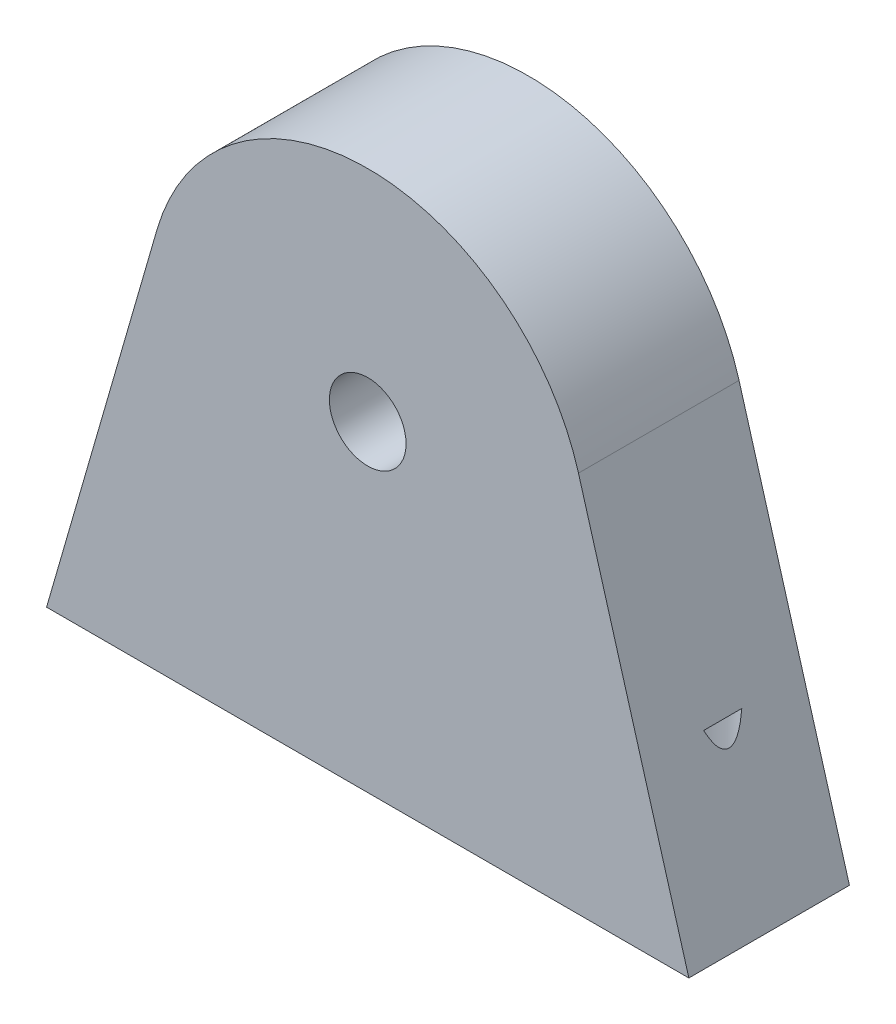
ISO-10303-21;
HEADER;
FILE_DESCRIPTION(('STEP AP214'),'2;1');
FILE_NAME('part.step','',(''),(''),'','','');
FILE_SCHEMA(('AUTOMOTIVE_DESIGN { 1 0 10303 214 1 1 1 1 }'));
ENDSEC;
DATA;
#1=APPLICATION_CONTEXT('core data for automotive mechanical design processes');
#2=APPLICATION_PROTOCOL_DEFINITION('international standard','automotive_design',2000,#1);
#3=PRODUCT_CONTEXT('',#1,'mechanical');
#4=PRODUCT('Part','Part','',(#3));
#5=PRODUCT_RELATED_PRODUCT_CATEGORY('part','',(#4));
#6=PRODUCT_DEFINITION_FORMATION('','',#4);
#7=PRODUCT_DEFINITION_CONTEXT('part definition',#1,'design');
#8=PRODUCT_DEFINITION('design','',#6,#7);
#9=PRODUCT_DEFINITION_SHAPE('','',#8);
#10=(LENGTH_UNIT() NAMED_UNIT(*) SI_UNIT(.MILLI.,.METRE.));
#11=(NAMED_UNIT(*) PLANE_ANGLE_UNIT() SI_UNIT($,.RADIAN.));
#12=(NAMED_UNIT(*) SI_UNIT($,.STERADIAN.) SOLID_ANGLE_UNIT());
#13=UNCERTAINTY_MEASURE_WITH_UNIT(LENGTH_MEASURE(1.E-05),#10,'distance_accuracy_value','');
#14=(GEOMETRIC_REPRESENTATION_CONTEXT(3) GLOBAL_UNCERTAINTY_ASSIGNED_CONTEXT((#13)) GLOBAL_UNIT_ASSIGNED_CONTEXT((#10,
#11,#12)) REPRESENTATION_CONTEXT('',''));
#15=CARTESIAN_POINT('',(0.,0.,0.));
#16=DIRECTION('',(0.,0.,1.));
#17=DIRECTION('',(1.,0.,0.));
#18=AXIS2_PLACEMENT_3D('',#15,#16,#17);
#19=CARTESIAN_POINT('',(0.,20.,5.));
#20=DIRECTION('',(0.,0.,1.));
#21=DIRECTION('',(1.,0.,0.));
#22=AXIS2_PLACEMENT_3D('',#19,#20,#21);
#23=PLANE('',#22);
#24=DIRECTION('',(-0.277604468966015,-0.960695455807977,0.));
#25=VECTOR('',#24,1.);
#26=CARTESIAN_POINT('',(-20.,0.,5.));
#27=LINE('',#26,#25);
#28=CARTESIAN_POINT('',(-13.1248481392492,23.7925822131547,5.));
#29=VERTEX_POINT('',#28);
#30=CARTESIAN_POINT('',(-20.,0.,5.));
#31=VERTEX_POINT('',#30);
#32=EDGE_CURVE('E114',#29,#31,#27,.T.);
#33=ORIENTED_EDGE('',*,*,#32,.T.);
#34=DIRECTION('',(1.,0.,0.));
#35=VECTOR('',#34,1.);
#36=CARTESIAN_POINT('',(-20.,0.,5.));
#37=LINE('',#36,#35);
#38=CARTESIAN_POINT('',(20.,0.,5.));
#39=VERTEX_POINT('',#38);
#40=EDGE_CURVE('E126',#31,#39,#37,.T.);
#41=ORIENTED_EDGE('',*,*,#40,.T.);
#42=DIRECTION('',(-0.277604468966015,0.960695455807977,0.));
#43=VECTOR('',#42,1.);
#44=CARTESIAN_POINT('',(13.1248481392492,23.7925822131547,5.));
#45=LINE('',#44,#43);
#46=CARTESIAN_POINT('',(13.1248481392492,23.7925822131547,5.));
#47=VERTEX_POINT('',#46);
#48=EDGE_CURVE('E124',#39,#47,#45,.T.);
#49=ORIENTED_EDGE('',*,*,#48,.T.);
#50=CARTESIAN_POINT('',(0.,20.,5.));
#51=DIRECTION('',(0.,0.,1.));
#52=DIRECTION('',(1.,0.,0.));
#53=AXIS2_PLACEMENT_3D('',#50,#51,#52);
#54=CIRCLE('',#53,13.6618197368392);
#55=EDGE_CURVE('E111',#47,#29,#54,.T.);
#56=ORIENTED_EDGE('',*,*,#55,.T.);
#57=EDGE_LOOP('',(#33,#41,#49,#56));
#58=FACE_BOUND('',#57,.T.);
#59=CARTESIAN_POINT('',(0.,20.,5.));
#60=DIRECTION('',(0.,0.,1.));
#61=DIRECTION('',(1.,0.,0.));
#62=AXIS2_PLACEMENT_3D('',#59,#60,#61);
#63=CIRCLE('',#62,2.3876);
#64=CARTESIAN_POINT('',(2.3876,20.,5.));
#65=VERTEX_POINT('',#64);
#66=EDGE_CURVE('E122',#65,#65,#63,.T.);
#67=ORIENTED_EDGE('',*,*,#66,.F.);
#68=EDGE_LOOP('',(#67));
#69=FACE_BOUND('',#68,.T.);
#70=ADVANCED_FACE('F36',(#58,#69),#23,.T.);
#71=CARTESIAN_POINT('',(0.,20.,-5.));
#72=DIRECTION('',(0.,0.,1.));
#73=DIRECTION('',(1.,0.,0.));
#74=AXIS2_PLACEMENT_3D('',#71,#72,#73);
#75=PLANE('',#74);
#76=DIRECTION('',(-0.277604468966015,-0.960695455807977,0.));
#77=VECTOR('',#76,1.);
#78=CARTESIAN_POINT('',(-20.,0.,-5.));
#79=LINE('',#78,#77);
#80=CARTESIAN_POINT('',(-13.1248481392492,23.7925822131547,-5.));
#81=VERTEX_POINT('',#80);
#82=CARTESIAN_POINT('',(-20.,0.,-5.));
#83=VERTEX_POINT('',#82);
#84=EDGE_CURVE('E119',#81,#83,#79,.T.);
#85=ORIENTED_EDGE('',*,*,#84,.F.);
#86=CARTESIAN_POINT('',(0.,20.,-5.));
#87=DIRECTION('',(0.,0.,1.));
#88=DIRECTION('',(1.,0.,0.));
#89=AXIS2_PLACEMENT_3D('',#86,#87,#88);
#90=CIRCLE('',#89,13.6618197368392);
#91=CARTESIAN_POINT('',(13.1248481392492,23.7925822131547,-5.));
#92=VERTEX_POINT('',#91);
#93=EDGE_CURVE('E112',#92,#81,#90,.T.);
#94=ORIENTED_EDGE('',*,*,#93,.F.);
#95=DIRECTION('',(-0.277604468966015,0.960695455807977,0.));
#96=VECTOR('',#95,1.);
#97=CARTESIAN_POINT('',(13.1248481392492,23.7925822131547,-5.));
#98=LINE('',#97,#96);
#99=CARTESIAN_POINT('',(20.,0.,-5.));
#100=VERTEX_POINT('',#99);
#101=EDGE_CURVE('E115',#100,#92,#98,.T.);
#102=ORIENTED_EDGE('',*,*,#101,.F.);
#103=DIRECTION('',(1.,0.,0.));
#104=VECTOR('',#103,1.);
#105=CARTESIAN_POINT('',(-20.,0.,-5.));
#106=LINE('',#105,#104);
#107=EDGE_CURVE('E117',#83,#100,#106,.T.);
#108=ORIENTED_EDGE('',*,*,#107,.F.);
#109=EDGE_LOOP('',(#85,#94,#102,#108));
#110=FACE_BOUND('',#109,.T.);
#111=CARTESIAN_POINT('',(0.,20.,-5.));
#112=DIRECTION('',(0.,0.,1.));
#113=DIRECTION('',(1.,0.,0.));
#114=AXIS2_PLACEMENT_3D('',#111,#112,#113);
#115=CIRCLE('',#114,2.3876);
#116=CARTESIAN_POINT('',(2.3876,20.,-5.));
#117=VERTEX_POINT('',#116);
#118=EDGE_CURVE('E130',#117,#117,#115,.T.);
#119=ORIENTED_EDGE('',*,*,#118,.T.);
#120=EDGE_LOOP('',(#119));
#121=FACE_BOUND('',#120,.T.);
#122=ADVANCED_FACE('F160',(#110,#121),#75,.F.);
#123=CARTESIAN_POINT('',(-20.,0.,5.));
#124=DIRECTION('',(0.960695455807977,-0.277604468966015,0.));
#125=DIRECTION('',(0.277604468966015,0.960695455807977,0.));
#126=AXIS2_PLACEMENT_3D('',#123,#124,#125);
#127=PLANE('',#126);
#128=DIRECTION('',(0.,0.,-1.));
#129=VECTOR('',#128,1.);
#130=CARTESIAN_POINT('',(-17.1103801179892,10.,5.));
#131=LINE('',#130,#129);
#132=CARTESIAN_POINT('',(-17.1103801179892,10.,1.18603367388328));
#133=VERTEX_POINT('',#132);
#134=CARTESIAN_POINT('',(-17.1103801179892,10.,-1.18603367388329));
#135=VERTEX_POINT('',#134);
#136=EDGE_CURVE('E11',#133,#135,#131,.T.);
#137=ORIENTED_EDGE('',*,*,#136,.F.);
#138=CARTESIAN_POINT('',(-15.5,15.5729825504543,0.));
#139=DIRECTION('',(0.960695455807977,-0.277604468966015,0.));
#140=DIRECTION('',(-0.277604468966015,-0.960695455807977,0.));
#141=AXIS2_PLACEMENT_3D('',#138,#139,#140);
#142=ELLIPSE('',#141,7.20449496886466,2.);
#143=EDGE_CURVE('E133',#133,#135,#142,.T.);
#144=ORIENTED_EDGE('',*,*,#143,.T.);
#145=EDGE_LOOP('',(#137,#144));
#146=FACE_BOUND('',#145,.T.);
#147=ORIENTED_EDGE('',*,*,#84,.T.);
#148=DIRECTION('',(0.,0.,-1.));
#149=VECTOR('',#148,1.);
#150=CARTESIAN_POINT('',(-20.,0.,5.));
#151=LINE('',#150,#149);
#152=EDGE_CURVE('E90',#31,#83,#151,.T.);
#153=ORIENTED_EDGE('',*,*,#152,.F.);
#154=ORIENTED_EDGE('',*,*,#32,.F.);
#155=DIRECTION('',(0.,0.,-1.));
#156=VECTOR('',#155,1.);
#157=CARTESIAN_POINT('',(-13.1248481392492,23.7925822131547,5.));
#158=LINE('',#157,#156);
#159=EDGE_CURVE('E108',#29,#81,#158,.T.);
#160=ORIENTED_EDGE('',*,*,#159,.T.);
#161=EDGE_LOOP('',(#147,#153,#154,#160));
#162=FACE_BOUND('',#161,.T.);
#163=ADVANCED_FACE('F38',(#146,#162),#127,.F.);
#164=CARTESIAN_POINT('',(-20.,0.,5.));
#165=DIRECTION('',(0.,1.,0.));
#166=DIRECTION('',(-1.,0.,0.));
#167=AXIS2_PLACEMENT_3D('',#164,#165,#166);
#168=PLANE('',#167);
#169=CARTESIAN_POINT('',(-15.5,0.,0.));
#170=DIRECTION('',(0.,-1.,0.));
#171=DIRECTION('',(1.,0.,0.));
#172=AXIS2_PLACEMENT_3D('',#169,#170,#171);
#173=CIRCLE('',#172,2.);
#174=CARTESIAN_POINT('',(-13.5,0.,0.));
#175=VERTEX_POINT('',#174);
#176=EDGE_CURVE('E94',#175,#175,#173,.T.);
#177=ORIENTED_EDGE('',*,*,#176,.F.);
#178=EDGE_LOOP('',(#177));
#179=FACE_BOUND('',#178,.T.);
#180=CARTESIAN_POINT('',(15.5,0.,0.));
#181=DIRECTION('',(0.,-1.,0.));
#182=DIRECTION('',(1.,0.,0.));
#183=AXIS2_PLACEMENT_3D('',#180,#181,#182);
#184=CIRCLE('',#183,2.);
#185=CARTESIAN_POINT('',(17.5,0.,0.));
#186=VERTEX_POINT('',#185);
#187=EDGE_CURVE('E95',#186,#186,#184,.T.);
#188=ORIENTED_EDGE('',*,*,#187,.F.);
#189=EDGE_LOOP('',(#188));
#190=FACE_BOUND('',#189,.T.);
#191=ORIENTED_EDGE('',*,*,#107,.T.);
#192=DIRECTION('',(0.,0.,-1.));
#193=VECTOR('',#192,1.);
#194=CARTESIAN_POINT('',(20.,0.,5.));
#195=LINE('',#194,#193);
#196=EDGE_CURVE('E102',#39,#100,#195,.T.);
#197=ORIENTED_EDGE('',*,*,#196,.F.);
#198=ORIENTED_EDGE('',*,*,#40,.F.);
#199=ORIENTED_EDGE('',*,*,#152,.T.);
#200=EDGE_LOOP('',(#191,#197,#198,#199));
#201=FACE_BOUND('',#200,.T.);
#202=ADVANCED_FACE('F147',(#179,#190,#201),#168,.F.);
#203=CARTESIAN_POINT('',(13.1248481392492,23.7925822131547,5.));
#204=DIRECTION('',(-0.960695455807977,-0.277604468966015,0.));
#205=DIRECTION('',(0.277604468966015,-0.960695455807977,0.));
#206=AXIS2_PLACEMENT_3D('',#203,#204,#205);
#207=PLANE('',#206);
#208=DIRECTION('',(0.,0.,1.));
#209=VECTOR('',#208,1.);
#210=CARTESIAN_POINT('',(17.1103801179892,10.,5.));
#211=LINE('',#210,#209);
#212=CARTESIAN_POINT('',(17.1103801179892,10.,-1.18603367388327));
#213=VERTEX_POINT('',#212);
#214=CARTESIAN_POINT('',(17.1103801179892,10.,1.18603367388328));
#215=VERTEX_POINT('',#214);
#216=EDGE_CURVE('E86',#213,#215,#211,.T.);
#217=ORIENTED_EDGE('',*,*,#216,.F.);
#218=CARTESIAN_POINT('',(15.5,15.5729825504544,0.));
#219=DIRECTION('',(-0.960695455807977,-0.277604468966015,0.));
#220=DIRECTION('',(0.277604468966015,-0.960695455807977,0.));
#221=AXIS2_PLACEMENT_3D('',#218,#219,#220);
#222=ELLIPSE('',#221,7.20449496886465,2.);
#223=EDGE_CURVE('E44',#213,#215,#222,.T.);
#224=ORIENTED_EDGE('',*,*,#223,.T.);
#225=EDGE_LOOP('',(#217,#224));
#226=FACE_BOUND('',#225,.T.);
#227=ORIENTED_EDGE('',*,*,#101,.T.);
#228=DIRECTION('',(0.,0.,-1.));
#229=VECTOR('',#228,1.);
#230=CARTESIAN_POINT('',(13.1248481392492,23.7925822131547,5.));
#231=LINE('',#230,#229);
#232=EDGE_CURVE('E105',#47,#92,#231,.T.);
#233=ORIENTED_EDGE('',*,*,#232,.F.);
#234=ORIENTED_EDGE('',*,*,#48,.F.);
#235=ORIENTED_EDGE('',*,*,#196,.T.);
#236=EDGE_LOOP('',(#227,#233,#234,#235));
#237=FACE_BOUND('',#236,.T.);
#238=ADVANCED_FACE('F97',(#226,#237),#207,.F.);
#239=CARTESIAN_POINT('',(0.,20.,5.));
#240=DIRECTION('',(0.,0.,-1.));
#241=DIRECTION('',(-1.,0.,0.));
#242=AXIS2_PLACEMENT_3D('',#239,#240,#241);
#243=CYLINDRICAL_SURFACE('',#242,13.6618197368392);
#244=ORIENTED_EDGE('',*,*,#93,.T.);
#245=ORIENTED_EDGE('',*,*,#159,.F.);
#246=ORIENTED_EDGE('',*,*,#55,.F.);
#247=ORIENTED_EDGE('',*,*,#232,.T.);
#248=EDGE_LOOP('',(#244,#245,#246,#247));
#249=FACE_BOUND('',#248,.T.);
#250=ADVANCED_FACE('F164',(#249),#243,.T.);
#251=CARTESIAN_POINT('',(0.,20.,5.));
#252=DIRECTION('',(0.,0.,-1.));
#253=DIRECTION('',(-1.,0.,0.));
#254=AXIS2_PLACEMENT_3D('',#251,#252,#253);
#255=CYLINDRICAL_SURFACE('',#254,2.3876);
#256=ORIENTED_EDGE('',*,*,#66,.T.);
#257=EDGE_LOOP('',(#256));
#258=FACE_BOUND('',#257,.T.);
#259=ORIENTED_EDGE('',*,*,#118,.F.);
#260=EDGE_LOOP('',(#259));
#261=FACE_BOUND('',#260,.T.);
#262=ADVANCED_FACE('F174',(#258,#261),#255,.F.);
#263=CARTESIAN_POINT('',(15.5,10.,0.));
#264=DIRECTION('',(0.,-1.,0.));
#265=DIRECTION('',(1.,0.,0.));
#266=AXIS2_PLACEMENT_3D('',#263,#264,#265);
#267=CYLINDRICAL_SURFACE('',#266,2.);
#268=ORIENTED_EDGE('',*,*,#187,.T.);
#269=EDGE_LOOP('',(#268));
#270=FACE_BOUND('',#269,.T.);
#271=CARTESIAN_POINT('',(15.5,10.,0.));
#272=DIRECTION('',(0.,-1.,0.));
#273=DIRECTION('',(1.,0.,0.));
#274=AXIS2_PLACEMENT_3D('',#271,#272,#273);
#275=CIRCLE('',#274,2.);
#276=EDGE_CURVE('E56',#215,#213,#275,.T.);
#277=ORIENTED_EDGE('',*,*,#276,.F.);
#278=ORIENTED_EDGE('',*,*,#223,.F.);
#279=EDGE_LOOP('',(#277,#278));
#280=FACE_BOUND('',#279,.T.);
#281=ADVANCED_FACE('F93',(#270,#280),#267,.F.);
#282=CARTESIAN_POINT('',(15.5,10.,0.));
#283=DIRECTION('',(0.,-1.,0.));
#284=DIRECTION('',(1.,0.,0.));
#285=AXIS2_PLACEMENT_3D('',#282,#283,#284);
#286=PLANE('',#285);
#287=ORIENTED_EDGE('',*,*,#216,.T.);
#288=ORIENTED_EDGE('',*,*,#276,.T.);
#289=EDGE_LOOP('',(#287,#288));
#290=FACE_BOUND('',#289,.T.);
#291=ADVANCED_FACE('F87',(#290),#286,.T.);
#292=CARTESIAN_POINT('',(-15.5,10.,0.));
#293=DIRECTION('',(0.,-1.,0.));
#294=DIRECTION('',(1.,0.,0.));
#295=AXIS2_PLACEMENT_3D('',#292,#293,#294);
#296=PLANE('',#295);
#297=ORIENTED_EDGE('',*,*,#136,.T.);
#298=CARTESIAN_POINT('',(-15.5,10.,0.));
#299=DIRECTION('',(0.,-1.,0.));
#300=DIRECTION('',(1.,0.,0.));
#301=AXIS2_PLACEMENT_3D('',#298,#299,#300);
#302=CIRCLE('',#301,2.);
#303=EDGE_CURVE('E49',#135,#133,#302,.T.);
#304=ORIENTED_EDGE('',*,*,#303,.T.);
#305=EDGE_LOOP('',(#297,#304));
#306=FACE_BOUND('',#305,.T.);
#307=ADVANCED_FACE('F215',(#306),#296,.T.);
#308=CARTESIAN_POINT('',(-15.5,10.,0.));
#309=DIRECTION('',(0.,-1.,0.));
#310=DIRECTION('',(1.,0.,0.));
#311=AXIS2_PLACEMENT_3D('',#308,#309,#310);
#312=CYLINDRICAL_SURFACE('',#311,2.);
#313=ORIENTED_EDGE('',*,*,#176,.T.);
#314=EDGE_LOOP('',(#313));
#315=FACE_BOUND('',#314,.T.);
#316=ORIENTED_EDGE('',*,*,#303,.F.);
#317=ORIENTED_EDGE('',*,*,#143,.F.);
#318=EDGE_LOOP('',(#316,#317));
#319=FACE_BOUND('',#318,.T.);
#320=ADVANCED_FACE('F144',(#315,#319),#312,.F.);
#321=CLOSED_SHELL('',(#70,#122,#163,#202,#238,#250,#262,#281,#291,#307,#320));
#322=MANIFOLD_SOLID_BREP('B2',#321);
#323=ADVANCED_BREP_SHAPE_REPRESENTATION('',(#18,#322),#14);
#324=SHAPE_DEFINITION_REPRESENTATION(#9,#323);
ENDSEC;
END-ISO-10303-21;
